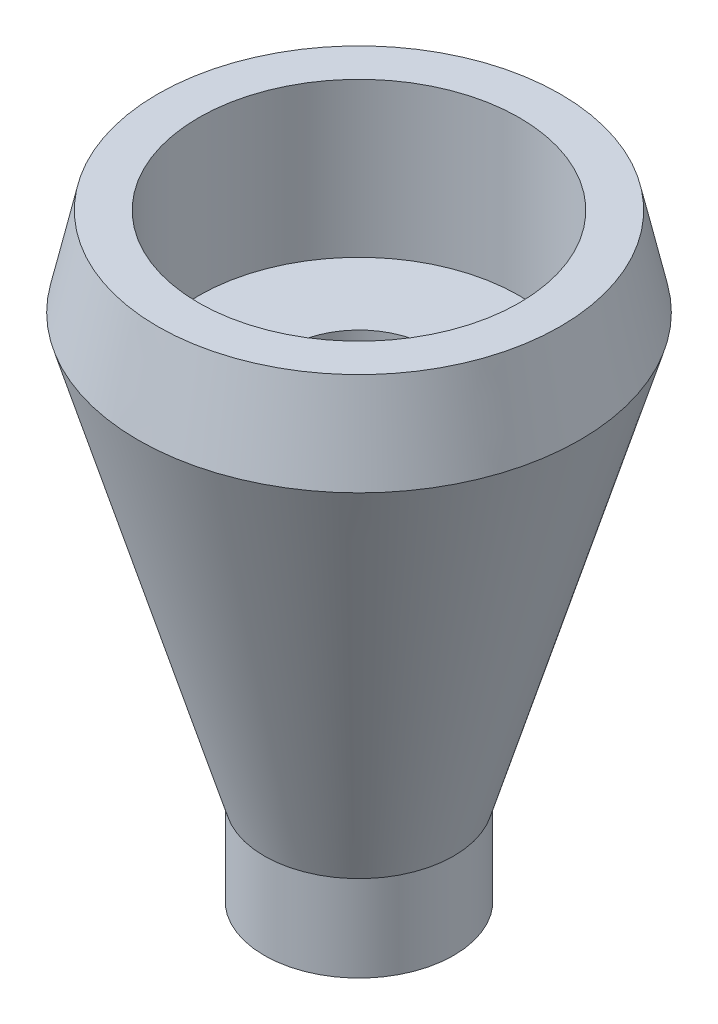
ISO-10303-21;
HEADER;
FILE_DESCRIPTION(('STEP AP214'),'2;1');
FILE_NAME('part.step','',(''),(''),'','','');
FILE_SCHEMA(('AUTOMOTIVE_DESIGN { 1 0 10303 214 1 1 1 1 }'));
ENDSEC;
DATA;
#1=APPLICATION_CONTEXT('core data for automotive mechanical design processes');
#2=APPLICATION_PROTOCOL_DEFINITION('international standard','automotive_design',2000,#1);
#3=PRODUCT_CONTEXT('',#1,'mechanical');
#4=PRODUCT('Part','Part','',(#3));
#5=PRODUCT_RELATED_PRODUCT_CATEGORY('part','',(#4));
#6=PRODUCT_DEFINITION_FORMATION('','',#4);
#7=PRODUCT_DEFINITION_CONTEXT('part definition',#1,'design');
#8=PRODUCT_DEFINITION('design','',#6,#7);
#9=PRODUCT_DEFINITION_SHAPE('','',#8);
#10=(LENGTH_UNIT() NAMED_UNIT(*) SI_UNIT(.MILLI.,.METRE.));
#11=(NAMED_UNIT(*) PLANE_ANGLE_UNIT() SI_UNIT($,.RADIAN.));
#12=(NAMED_UNIT(*) SI_UNIT($,.STERADIAN.) SOLID_ANGLE_UNIT());
#13=UNCERTAINTY_MEASURE_WITH_UNIT(LENGTH_MEASURE(1.E-05),#10,'distance_accuracy_value','');
#14=(GEOMETRIC_REPRESENTATION_CONTEXT(3) GLOBAL_UNCERTAINTY_ASSIGNED_CONTEXT((#13)) GLOBAL_UNIT_ASSIGNED_CONTEXT((#10,
#11,#12)) REPRESENTATION_CONTEXT('',''));
#15=CARTESIAN_POINT('',(0.,0.,0.));
#16=DIRECTION('',(0.,0.,1.));
#17=DIRECTION('',(1.,0.,0.));
#18=AXIS2_PLACEMENT_3D('',#15,#16,#17);
#19=CARTESIAN_POINT('',(-7.10834936745735,0.,0.));
#20=DIRECTION('',(0.,1.,0.));
#21=DIRECTION('',(-1.,0.,0.));
#22=AXIS2_PLACEMENT_3D('',#19,#20,#21);
#23=PLANE('',#22);
#24=CARTESIAN_POINT('',(-7.10834936745735,0.,0.));
#25=DIRECTION('',(0.,1.,0.));
#26=DIRECTION('',(-1.,0.,0.));
#27=AXIS2_PLACEMENT_3D('',#24,#25,#26);
#28=CIRCLE('',#27,7.10834936745735);
#29=CARTESIAN_POINT('',(-14.2166987349147,0.,0.));
#30=VERTEX_POINT('',#29);
#31=EDGE_CURVE('E10',#30,#30,#28,.T.);
#32=ORIENTED_EDGE('',*,*,#31,.F.);
#33=EDGE_LOOP('',(#32));
#34=FACE_BOUND('',#33,.T.);
#35=ADVANCED_FACE('F32',(#34),#23,.F.);
#36=CARTESIAN_POINT('',(-7.10834936745736,6.46213578859758,0.));
#37=DIRECTION('',(0.,1.,0.));
#38=DIRECTION('',(-1.,0.,0.));
#39=AXIS2_PLACEMENT_3D('',#36,#37,#38);
#40=CYLINDRICAL_SURFACE('',#39,7.10834936745735);
#41=CARTESIAN_POINT('',(-7.10834936745736,6.46213578859758,0.));
#42=DIRECTION('',(0.,1.,0.));
#43=DIRECTION('',(-1.,0.,0.));
#44=AXIS2_PLACEMENT_3D('',#41,#42,#43);
#45=CIRCLE('',#44,7.10834936745736);
#46=CARTESIAN_POINT('',(-14.2166987349147,6.46213578859758,0.));
#47=VERTEX_POINT('',#46);
#48=EDGE_CURVE('E38',#47,#47,#45,.T.);
#49=ORIENTED_EDGE('',*,*,#48,.F.);
#50=EDGE_LOOP('',(#49));
#51=FACE_BOUND('',#50,.T.);
#52=ORIENTED_EDGE('',*,*,#31,.T.);
#53=EDGE_LOOP('',(#52));
#54=FACE_BOUND('',#53,.T.);
#55=ADVANCED_FACE('F98',(#51,#54),#40,.T.);
#56=CARTESIAN_POINT('',(-7.10834936745736,6.46213578859758,0.));
#57=DIRECTION('',(0.,1.,0.));
#58=DIRECTION('',(-1.,0.,0.));
#59=AXIS2_PLACEMENT_3D('',#56,#57,#58);
#60=CONICAL_SURFACE('',#59,7.10834936745736,0.289588884709009);
#61=CARTESIAN_POINT('',(-7.10834936745736,38.2189173782772,0.));
#62=DIRECTION('',(0.,1.,0.));
#63=DIRECTION('',(-1.,0.,0.));
#64=AXIS2_PLACEMENT_3D('',#61,#62,#63);
#65=CIRCLE('',#64,16.5707624864753);
#66=CARTESIAN_POINT('',(-23.6791118539326,38.2189173782772,0.));
#67=VERTEX_POINT('',#66);
#68=EDGE_CURVE('E42',#67,#67,#65,.T.);
#69=ORIENTED_EDGE('',*,*,#68,.F.);
#70=EDGE_LOOP('',(#69));
#71=FACE_BOUND('',#70,.T.);
#72=ORIENTED_EDGE('',*,*,#48,.T.);
#73=EDGE_LOOP('',(#72));
#74=FACE_BOUND('',#73,.T.);
#75=ADVANCED_FACE('F93',(#71,#74),#60,.T.);
#76=CARTESIAN_POINT('',(-7.10834936745736,38.2189173782772,0.));
#77=DIRECTION('',(0.,-1.,0.));
#78=DIRECTION('',(1.,0.,0.));
#79=AXIS2_PLACEMENT_3D('',#76,#77,#78);
#80=CONICAL_SURFACE('',#79,16.5707624864753,0.217065702474292);
#81=CARTESIAN_POINT('',(-7.10834936745736,44.8656856179775,0.));
#82=DIRECTION('',(0.,1.,0.));
#83=DIRECTION('',(-1.,0.,0.));
#84=AXIS2_PLACEMENT_3D('',#81,#82,#83);
#85=CIRCLE('',#84,15.1048815331985);
#86=CARTESIAN_POINT('',(-22.2132309006559,44.8656856179775,0.));
#87=VERTEX_POINT('',#86);
#88=EDGE_CURVE('E46',#87,#87,#85,.T.);
#89=ORIENTED_EDGE('',*,*,#88,.F.);
#90=EDGE_LOOP('',(#89));
#91=FACE_BOUND('',#90,.T.);
#92=ORIENTED_EDGE('',*,*,#68,.T.);
#93=EDGE_LOOP('',(#92));
#94=FACE_BOUND('',#93,.T.);
#95=ADVANCED_FACE('F87',(#91,#94),#80,.T.);
#96=CARTESIAN_POINT('',(7.99653216574117,44.8656856179775,0.));
#97=DIRECTION('',(0.,-1.,0.));
#98=DIRECTION('',(1.,0.,0.));
#99=AXIS2_PLACEMENT_3D('',#96,#97,#98);
#100=PLANE('',#99);
#101=CARTESIAN_POINT('',(-7.10834936745736,44.8656856179775,0.));
#102=DIRECTION('',(0.,1.,0.));
#103=DIRECTION('',(-1.,0.,0.));
#104=AXIS2_PLACEMENT_3D('',#101,#102,#103);
#105=CIRCLE('',#104,12.0343689023184);
#106=CARTESIAN_POINT('',(-19.1427182697758,44.8656856179775,0.));
#107=VERTEX_POINT('',#106);
#108=EDGE_CURVE('E51',#107,#107,#105,.T.);
#109=ORIENTED_EDGE('',*,*,#108,.F.);
#110=EDGE_LOOP('',(#109));
#111=FACE_BOUND('',#110,.T.);
#112=ORIENTED_EDGE('',*,*,#88,.T.);
#113=EDGE_LOOP('',(#112));
#114=FACE_BOUND('',#113,.T.);
#115=ADVANCED_FACE('F81',(#111,#114),#100,.F.);
#116=CARTESIAN_POINT('',(-7.10834936745736,6.46213578859758,0.));
#117=DIRECTION('',(0.,1.,0.));
#118=DIRECTION('',(-1.,0.,0.));
#119=AXIS2_PLACEMENT_3D('',#116,#117,#118);
#120=CYLINDRICAL_SURFACE('',#119,12.0343689023184);
#121=CARTESIAN_POINT('',(-7.10834936745736,33.2992778863046,0.));
#122=DIRECTION('',(0.,1.,0.));
#123=DIRECTION('',(-1.,0.,0.));
#124=AXIS2_PLACEMENT_3D('',#121,#122,#123);
#125=CIRCLE('',#124,12.0343689023184);
#126=CARTESIAN_POINT('',(-19.1427182697758,33.2992778863046,0.));
#127=VERTEX_POINT('',#126);
#128=EDGE_CURVE('E54',#127,#127,#125,.T.);
#129=ORIENTED_EDGE('',*,*,#128,.F.);
#130=EDGE_LOOP('',(#129));
#131=FACE_BOUND('',#130,.T.);
#132=ORIENTED_EDGE('',*,*,#108,.T.);
#133=EDGE_LOOP('',(#132));
#134=FACE_BOUND('',#133,.T.);
#135=ADVANCED_FACE('F75',(#131,#134),#120,.F.);
#136=CARTESIAN_POINT('',(4.92601953486105,33.2992778863046,0.));
#137=DIRECTION('',(0.,-1.,0.));
#138=DIRECTION('',(1.,0.,0.));
#139=AXIS2_PLACEMENT_3D('',#136,#137,#138);
#140=PLANE('',#139);
#141=CARTESIAN_POINT('',(-7.10834936745736,33.2992778863046,0.));
#142=DIRECTION('',(0.,1.,0.));
#143=DIRECTION('',(-1.,0.,0.));
#144=AXIS2_PLACEMENT_3D('',#141,#142,#143);
#145=CIRCLE('',#144,5.35434108198085);
#146=CARTESIAN_POINT('',(-12.4626904494382,33.2992778863046,0.));
#147=VERTEX_POINT('',#146);
#148=EDGE_CURVE('E57',#147,#147,#145,.T.);
#149=ORIENTED_EDGE('',*,*,#148,.F.);
#150=EDGE_LOOP('',(#149));
#151=FACE_BOUND('',#150,.T.);
#152=ORIENTED_EDGE('',*,*,#128,.T.);
#153=EDGE_LOOP('',(#152));
#154=FACE_BOUND('',#153,.T.);
#155=ADVANCED_FACE('F69',(#151,#154),#140,.F.);
#156=CARTESIAN_POINT('',(-7.10834936745736,6.46213578859758,0.));
#157=DIRECTION('',(0.,1.,0.));
#158=DIRECTION('',(-1.,0.,0.));
#159=AXIS2_PLACEMENT_3D('',#156,#157,#158);
#160=CYLINDRICAL_SURFACE('',#159,5.35434108198085);
#161=CARTESIAN_POINT('',(-7.10834936745736,6.46213578859758,0.));
#162=DIRECTION('',(0.,1.,0.));
#163=DIRECTION('',(-1.,0.,0.));
#164=AXIS2_PLACEMENT_3D('',#161,#162,#163);
#165=CIRCLE('',#164,5.35434108198085);
#166=CARTESIAN_POINT('',(-12.4626904494382,6.46213578859758,0.));
#167=VERTEX_POINT('',#166);
#168=EDGE_CURVE('E60',#167,#167,#165,.T.);
#169=ORIENTED_EDGE('',*,*,#168,.F.);
#170=EDGE_LOOP('',(#169));
#171=FACE_BOUND('',#170,.T.);
#172=ORIENTED_EDGE('',*,*,#148,.T.);
#173=EDGE_LOOP('',(#172));
#174=FACE_BOUND('',#173,.T.);
#175=ADVANCED_FACE('F66',(#171,#174),#160,.F.);
#176=CARTESIAN_POINT('',(-1.7540082854765,6.46213578859758,0.));
#177=DIRECTION('',(0.,-1.,0.));
#178=DIRECTION('',(1.,0.,0.));
#179=AXIS2_PLACEMENT_3D('',#176,#177,#178);
#180=PLANE('',#179);
#181=ORIENTED_EDGE('',*,*,#168,.T.);
#182=EDGE_LOOP('',(#181));
#183=FACE_BOUND('',#182,.T.);
#184=ADVANCED_FACE('F64',(#183),#180,.F.);
#185=CLOSED_SHELL('',(#35,#55,#75,#95,#115,#135,#155,#175,#184));
#186=MANIFOLD_SOLID_BREP('B2',#185);
#187=ADVANCED_BREP_SHAPE_REPRESENTATION('',(#18,#186),#14);
#188=SHAPE_DEFINITION_REPRESENTATION(#9,#187);
ENDSEC;
END-ISO-10303-21;
